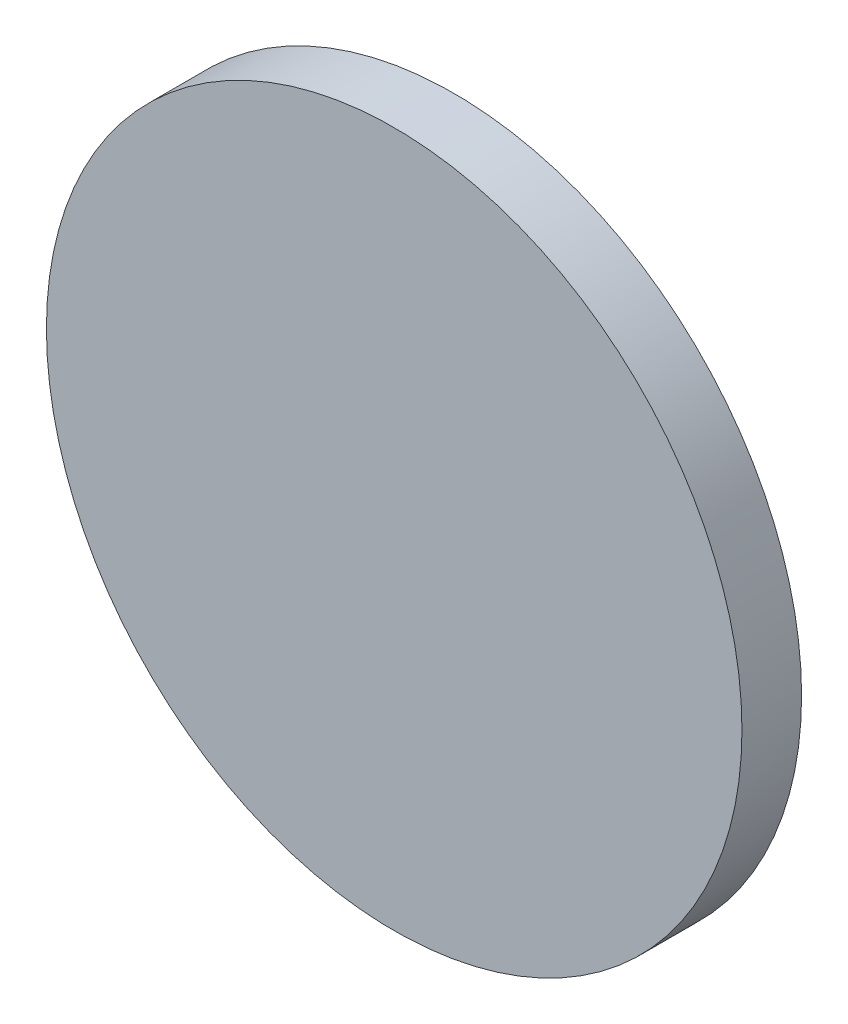
ISO-10303-21;
HEADER;
FILE_DESCRIPTION(('STEP AP214'),'2;1');
FILE_NAME('part.step','',(''),(''),'','','');
FILE_SCHEMA(('AUTOMOTIVE_DESIGN { 1 0 10303 214 1 1 1 1 }'));
ENDSEC;
DATA;
#1=APPLICATION_CONTEXT('core data for automotive mechanical design processes');
#2=APPLICATION_PROTOCOL_DEFINITION('international standard','automotive_design',2000,#1);
#3=PRODUCT_CONTEXT('',#1,'mechanical');
#4=PRODUCT('Part','Part','',(#3));
#5=PRODUCT_RELATED_PRODUCT_CATEGORY('part','',(#4));
#6=PRODUCT_DEFINITION_FORMATION('','',#4);
#7=PRODUCT_DEFINITION_CONTEXT('part definition',#1,'design');
#8=PRODUCT_DEFINITION('design','',#6,#7);
#9=PRODUCT_DEFINITION_SHAPE('','',#8);
#10=(LENGTH_UNIT() NAMED_UNIT(*) SI_UNIT(.MILLI.,.METRE.));
#11=(NAMED_UNIT(*) PLANE_ANGLE_UNIT() SI_UNIT($,.RADIAN.));
#12=(NAMED_UNIT(*) SI_UNIT($,.STERADIAN.) SOLID_ANGLE_UNIT());
#13=UNCERTAINTY_MEASURE_WITH_UNIT(LENGTH_MEASURE(1.E-05),#10,'distance_accuracy_value','');
#14=(GEOMETRIC_REPRESENTATION_CONTEXT(3) GLOBAL_UNCERTAINTY_ASSIGNED_CONTEXT((#13)) GLOBAL_UNIT_ASSIGNED_CONTEXT((#10,
#11,#12)) REPRESENTATION_CONTEXT('',''));
#15=CARTESIAN_POINT('',(0.,0.,0.));
#16=DIRECTION('',(0.,0.,1.));
#17=DIRECTION('',(1.,0.,0.));
#18=AXIS2_PLACEMENT_3D('',#15,#16,#17);
#19=CARTESIAN_POINT('',(3.69062,5.674360006176,0.79916));
#20=DIRECTION('',(0.,0.,1.));
#21=DIRECTION('',(1.,0.,0.));
#22=AXIS2_PLACEMENT_3D('',#19,#20,#21);
#23=PLANE('',#22);
#24=CARTESIAN_POINT('',(3.69062,5.674360006176,0.79916));
#25=DIRECTION('',(0.,0.,1.));
#26=DIRECTION('',(1.,0.,0.));
#27=AXIS2_PLACEMENT_3D('',#24,#25,#26);
#28=CIRCLE('',#27,0.200024667);
#29=CARTESIAN_POINT('',(3.890644667,5.674360006176,0.79916));
#30=VERTEX_POINT('',#29);
#31=EDGE_CURVE('E18',#30,#30,#28,.F.);
#32=ORIENTED_EDGE('',*,*,#31,.F.);
#33=EDGE_LOOP('',(#32));
#34=FACE_BOUND('',#33,.T.);
#35=ADVANCED_FACE('F15',(#34),#23,.T.);
#36=CARTESIAN_POINT('',(3.69062,5.674360006176,0.76487));
#37=DIRECTION('',(0.,0.,1.));
#38=DIRECTION('',(1.,0.,0.));
#39=AXIS2_PLACEMENT_3D('',#36,#37,#38);
#40=CYLINDRICAL_SURFACE('',#39,0.200024667);
#41=ORIENTED_EDGE('',*,*,#31,.T.);
#42=EDGE_LOOP('',(#41));
#43=FACE_BOUND('',#42,.T.);
#44=CARTESIAN_POINT('',(3.69062,5.674360006176,0.76487));
#45=DIRECTION('',(0.,0.,1.));
#46=DIRECTION('',(1.,0.,0.));
#47=AXIS2_PLACEMENT_3D('',#44,#45,#46);
#48=CIRCLE('',#47,0.200024667);
#49=CARTESIAN_POINT('',(3.890644667,5.674360006176,0.76487));
#50=VERTEX_POINT('',#49);
#51=EDGE_CURVE('E10',#50,#50,#48,.F.);
#52=ORIENTED_EDGE('',*,*,#51,.F.);
#53=EDGE_LOOP('',(#52));
#54=FACE_BOUND('',#53,.T.);
#55=ADVANCED_FACE('F27',(#43,#54),#40,.T.);
#56=CARTESIAN_POINT('',(3.69062,5.674360006176,0.76487));
#57=DIRECTION('',(0.,0.,-1.));
#58=DIRECTION('',(-1.,0.,0.));
#59=AXIS2_PLACEMENT_3D('',#56,#57,#58);
#60=PLANE('',#59);
#61=ORIENTED_EDGE('',*,*,#51,.T.);
#62=EDGE_LOOP('',(#61));
#63=FACE_BOUND('',#62,.T.);
#64=ADVANCED_FACE('F35',(#63),#60,.T.);
#65=CLOSED_SHELL('',(#35,#55,#64));
#66=MANIFOLD_SOLID_BREP('B1',#65);
#67=ADVANCED_BREP_SHAPE_REPRESENTATION('',(#18,#66),#14);
#68=SHAPE_DEFINITION_REPRESENTATION(#9,#67);
ENDSEC;
END-ISO-10303-21;
